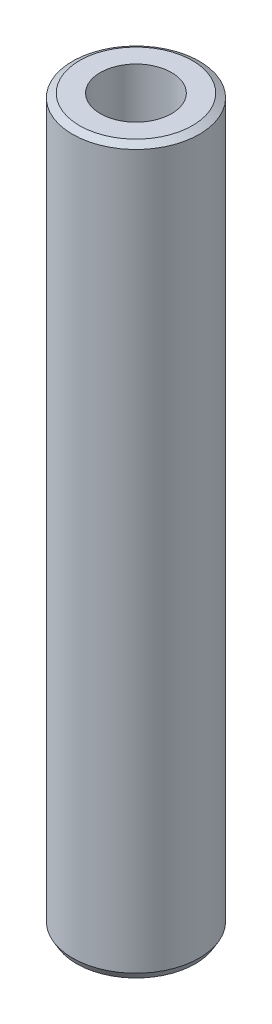
ISO-10303-21;
HEADER;
FILE_DESCRIPTION(('STEP AP214'),'2;1');
FILE_NAME('part.step','',(''),(''),'','','');
FILE_SCHEMA(('AUTOMOTIVE_DESIGN { 1 0 10303 214 1 1 1 1 }'));
ENDSEC;
DATA;
#1=APPLICATION_CONTEXT('core data for automotive mechanical design processes');
#2=APPLICATION_PROTOCOL_DEFINITION('international standard','automotive_design',2000,#1);
#3=PRODUCT_CONTEXT('',#1,'mechanical');
#4=PRODUCT('Part','Part','',(#3));
#5=PRODUCT_RELATED_PRODUCT_CATEGORY('part','',(#4));
#6=PRODUCT_DEFINITION_FORMATION('','',#4);
#7=PRODUCT_DEFINITION_CONTEXT('part definition',#1,'design');
#8=PRODUCT_DEFINITION('design','',#6,#7);
#9=PRODUCT_DEFINITION_SHAPE('','',#8);
#10=(LENGTH_UNIT() NAMED_UNIT(*) SI_UNIT(.MILLI.,.METRE.));
#11=(NAMED_UNIT(*) PLANE_ANGLE_UNIT() SI_UNIT($,.RADIAN.));
#12=(NAMED_UNIT(*) SI_UNIT($,.STERADIAN.) SOLID_ANGLE_UNIT());
#13=UNCERTAINTY_MEASURE_WITH_UNIT(LENGTH_MEASURE(1.E-05),#10,'distance_accuracy_value','');
#14=(GEOMETRIC_REPRESENTATION_CONTEXT(3) GLOBAL_UNCERTAINTY_ASSIGNED_CONTEXT((#13)) GLOBAL_UNIT_ASSIGNED_CONTEXT((#10,
#11,#12)) REPRESENTATION_CONTEXT('',''));
#15=CARTESIAN_POINT('',(0.,0.,0.));
#16=DIRECTION('',(0.,0.,1.));
#17=DIRECTION('',(1.,0.,0.));
#18=AXIS2_PLACEMENT_3D('',#15,#16,#17);
#19=CARTESIAN_POINT('',(0.,371.418984331781,0.));
#20=DIRECTION('',(0.,-1.,0.));
#21=DIRECTION('',(0.,0.,-1.));
#22=AXIS2_PLACEMENT_3D('',#19,#20,#21);
#23=CYLINDRICAL_SURFACE('',#22,32.5);
#24=CARTESIAN_POINT('',(0.,369.352410161099,0.));
#25=DIRECTION('',(0.,1.,0.));
#26=DIRECTION('',(0.,0.,1.));
#27=AXIS2_PLACEMENT_3D('',#24,#25,#26);
#28=CIRCLE('',#27,32.5);
#29=CARTESIAN_POINT('',(0.,369.352410161099,32.5));
#30=VERTEX_POINT('',#29);
#31=EDGE_CURVE('E50',#30,#30,#28,.F.);
#32=ORIENTED_EDGE('',*,*,#31,.T.);
#33=EDGE_LOOP('',(#32));
#34=FACE_BOUND('',#33,.T.);
#35=CARTESIAN_POINT('',(0.,3.57941146123075,0.));
#36=DIRECTION('',(0.,1.,0.));
#37=DIRECTION('',(0.,0.,1.));
#38=AXIS2_PLACEMENT_3D('',#35,#36,#37);
#39=CIRCLE('',#38,32.5);
#40=CARTESIAN_POINT('',(0.,3.57941146123075,32.5));
#41=VERTEX_POINT('',#40);
#42=EDGE_CURVE('E51',#41,#41,#39,.T.);
#43=ORIENTED_EDGE('',*,*,#42,.T.);
#44=EDGE_LOOP('',(#43));
#45=FACE_BOUND('',#44,.T.);
#46=ADVANCED_FACE('F39',(#34,#45),#23,.T.);
#47=CARTESIAN_POINT('',(0.,371.418984331781,0.));
#48=DIRECTION('',(0.,1.,0.));
#49=DIRECTION('',(0.,0.,1.));
#50=AXIS2_PLACEMENT_3D('',#47,#48,#49);
#51=PLANE('',#50);
#52=CARTESIAN_POINT('',(0.,371.418984331781,0.));
#53=DIRECTION('',(0.,1.,0.));
#54=DIRECTION('',(0.,0.,1.));
#55=AXIS2_PLACEMENT_3D('',#52,#53,#54);
#56=CIRCLE('',#55,28.9205885387693);
#57=CARTESIAN_POINT('',(0.,371.418984331781,28.9205885387693));
#58=VERTEX_POINT('',#57);
#59=EDGE_CURVE('E54',#58,#58,#56,.T.);
#60=ORIENTED_EDGE('',*,*,#59,.T.);
#61=EDGE_LOOP('',(#60));
#62=FACE_BOUND('',#61,.T.);
#63=CARTESIAN_POINT('',(0.,371.418984331781,0.));
#64=DIRECTION('',(0.,1.,0.));
#65=DIRECTION('',(0.,0.,1.));
#66=AXIS2_PLACEMENT_3D('',#63,#64,#65);
#67=CIRCLE('',#66,18.2741563029269);
#68=CARTESIAN_POINT('',(0.,371.418984331781,18.2741563029269));
#69=VERTEX_POINT('',#68);
#70=EDGE_CURVE('E58',#69,#69,#67,.T.);
#71=ORIENTED_EDGE('',*,*,#70,.F.);
#72=EDGE_LOOP('',(#71));
#73=FACE_BOUND('',#72,.T.);
#74=ADVANCED_FACE('F69',(#62,#73),#51,.T.);
#75=CARTESIAN_POINT('',(0.,0.,0.));
#76=DIRECTION('',(0.,1.,0.));
#77=DIRECTION('',(0.,0.,1.));
#78=AXIS2_PLACEMENT_3D('',#75,#76,#77);
#79=PLANE('',#78);
#80=CARTESIAN_POINT('',(0.,0.,0.));
#81=DIRECTION('',(0.,1.,0.));
#82=DIRECTION('',(0.,0.,1.));
#83=AXIS2_PLACEMENT_3D('',#80,#81,#82);
#84=CIRCLE('',#83,30.433425829318);
#85=CARTESIAN_POINT('',(0.,0.,30.433425829318));
#86=VERTEX_POINT('',#85);
#87=EDGE_CURVE('E10',#86,#86,#84,.F.);
#88=ORIENTED_EDGE('',*,*,#87,.T.);
#89=EDGE_LOOP('',(#88));
#90=FACE_BOUND('',#89,.T.);
#91=CARTESIAN_POINT('',(0.,0.,0.));
#92=DIRECTION('',(0.,1.,0.));
#93=DIRECTION('',(0.,0.,1.));
#94=AXIS2_PLACEMENT_3D('',#91,#92,#93);
#95=CIRCLE('',#94,18.2741563029269);
#96=CARTESIAN_POINT('',(0.,0.,18.2741563029269));
#97=VERTEX_POINT('',#96);
#98=EDGE_CURVE('E63',#97,#97,#95,.T.);
#99=ORIENTED_EDGE('',*,*,#98,.T.);
#100=EDGE_LOOP('',(#99));
#101=FACE_BOUND('',#100,.T.);
#102=ADVANCED_FACE('F75',(#90,#101),#79,.F.);
#103=CARTESIAN_POINT('',(0.,371.418984331781,0.));
#104=DIRECTION('',(0.,-1.,0.));
#105=DIRECTION('',(0.,0.,-1.));
#106=AXIS2_PLACEMENT_3D('',#103,#104,#105);
#107=CYLINDRICAL_SURFACE('',#106,18.2741563029269);
#108=ORIENTED_EDGE('',*,*,#70,.T.);
#109=EDGE_LOOP('',(#108));
#110=FACE_BOUND('',#109,.T.);
#111=ORIENTED_EDGE('',*,*,#98,.F.);
#112=EDGE_LOOP('',(#111));
#113=FACE_BOUND('',#112,.T.);
#114=ADVANCED_FACE('F70',(#110,#113),#107,.F.);
#115=CARTESIAN_POINT('',(0.,371.418984331781,0.));
#116=DIRECTION('',(0.,-1.,0.));
#117=DIRECTION('',(0.,0.,-1.));
#118=AXIS2_PLACEMENT_3D('',#115,#116,#117);
#119=CONICAL_SURFACE('',#118,28.9205885387693,1.04719755119658);
#120=ORIENTED_EDGE('',*,*,#31,.F.);
#121=EDGE_LOOP('',(#120));
#122=FACE_BOUND('',#121,.T.);
#123=ORIENTED_EDGE('',*,*,#59,.F.);
#124=EDGE_LOOP('',(#123));
#125=FACE_BOUND('',#124,.T.);
#126=ADVANCED_FACE('F81',(#122,#125),#119,.T.);
#127=CARTESIAN_POINT('',(0.,3.57941146123075,0.));
#128=DIRECTION('',(0.,1.,0.));
#129=DIRECTION('',(0.,0.,1.));
#130=AXIS2_PLACEMENT_3D('',#127,#128,#129);
#131=CONICAL_SURFACE('',#130,32.5,0.5235987755983);
#132=ORIENTED_EDGE('',*,*,#87,.F.);
#133=EDGE_LOOP('',(#132));
#134=FACE_BOUND('',#133,.T.);
#135=ORIENTED_EDGE('',*,*,#42,.F.);
#136=EDGE_LOOP('',(#135));
#137=FACE_BOUND('',#136,.T.);
#138=ADVANCED_FACE('F45',(#134,#137),#131,.T.);
#139=CLOSED_SHELL('',(#46,#74,#102,#114,#126,#138));
#140=MANIFOLD_SOLID_BREP('B2',#139);
#141=ADVANCED_BREP_SHAPE_REPRESENTATION('',(#18,#140),#14);
#142=SHAPE_DEFINITION_REPRESENTATION(#9,#141);
ENDSEC;
END-ISO-10303-21;
